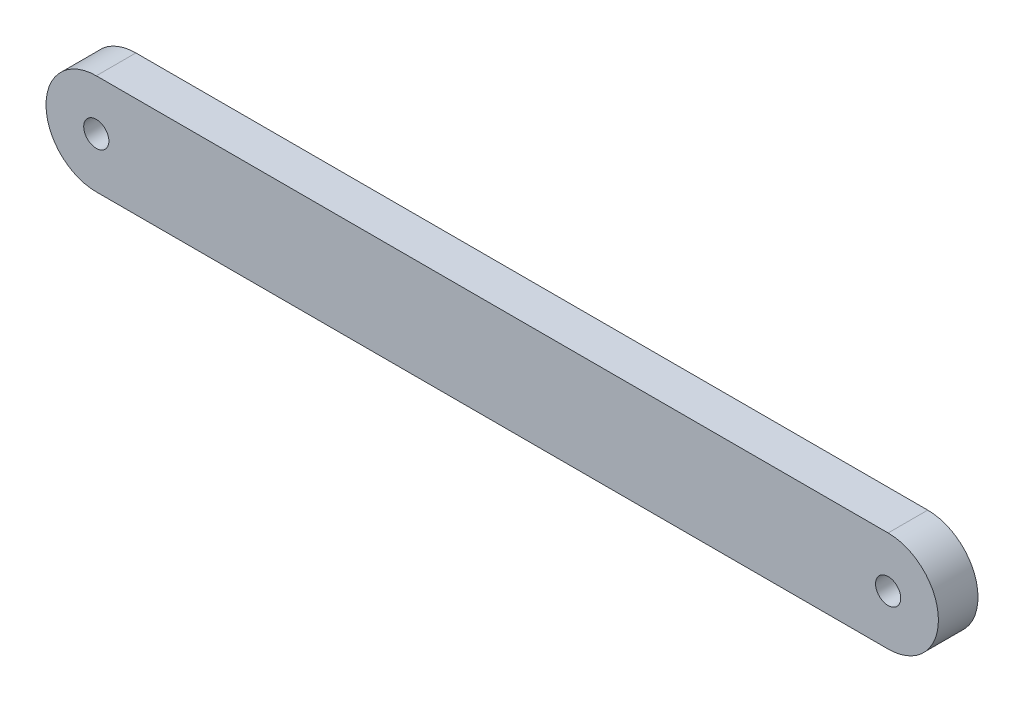
ISO-10303-21;
HEADER;
FILE_DESCRIPTION(('STEP AP214'),'2;1');
FILE_NAME('part.step','',(''),(''),'','','');
FILE_SCHEMA(('AUTOMOTIVE_DESIGN { 1 0 10303 214 1 1 1 1 }'));
ENDSEC;
DATA;
#1=APPLICATION_CONTEXT('core data for automotive mechanical design processes');
#2=APPLICATION_PROTOCOL_DEFINITION('international standard','automotive_design',2000,#1);
#3=PRODUCT_CONTEXT('',#1,'mechanical');
#4=PRODUCT('Part','Part','',(#3));
#5=PRODUCT_RELATED_PRODUCT_CATEGORY('part','',(#4));
#6=PRODUCT_DEFINITION_FORMATION('','',#4);
#7=PRODUCT_DEFINITION_CONTEXT('part definition',#1,'design');
#8=PRODUCT_DEFINITION('design','',#6,#7);
#9=PRODUCT_DEFINITION_SHAPE('','',#8);
#10=(LENGTH_UNIT() NAMED_UNIT(*) SI_UNIT(.MILLI.,.METRE.));
#11=(NAMED_UNIT(*) PLANE_ANGLE_UNIT() SI_UNIT($,.RADIAN.));
#12=(NAMED_UNIT(*) SI_UNIT($,.STERADIAN.) SOLID_ANGLE_UNIT());
#13=UNCERTAINTY_MEASURE_WITH_UNIT(LENGTH_MEASURE(1.E-05),#10,'distance_accuracy_value','');
#14=(GEOMETRIC_REPRESENTATION_CONTEXT(3) GLOBAL_UNCERTAINTY_ASSIGNED_CONTEXT((#13)) GLOBAL_UNIT_ASSIGNED_CONTEXT((#10,
#11,#12)) REPRESENTATION_CONTEXT('',''));
#15=CARTESIAN_POINT('',(0.,0.,0.));
#16=DIRECTION('',(0.,0.,1.));
#17=DIRECTION('',(1.,0.,0.));
#18=AXIS2_PLACEMENT_3D('',#15,#16,#17);
#19=CARTESIAN_POINT('',(0.,0.,10.));
#20=DIRECTION('',(0.,0.,1.));
#21=DIRECTION('',(1.,0.,0.));
#22=AXIS2_PLACEMENT_3D('',#19,#20,#21);
#23=PLANE('',#22);
#24=CARTESIAN_POINT('',(200.,0.,10.));
#25=DIRECTION('',(0.,0.,1.));
#26=DIRECTION('',(1.,0.,0.));
#27=AXIS2_PLACEMENT_3D('',#24,#25,#26);
#28=CIRCLE('',#27,3.17499999999997);
#29=CARTESIAN_POINT('',(203.175,0.,10.));
#30=VERTEX_POINT('',#29);
#31=EDGE_CURVE('E100',#30,#30,#28,.T.);
#32=ORIENTED_EDGE('',*,*,#31,.F.);
#33=EDGE_LOOP('',(#32));
#34=FACE_BOUND('',#33,.T.);
#35=CARTESIAN_POINT('',(0.,0.,10.));
#36=DIRECTION('',(0.,0.,1.));
#37=DIRECTION('',(1.,0.,0.));
#38=AXIS2_PLACEMENT_3D('',#35,#36,#37);
#39=CIRCLE('',#38,12.7);
#40=CARTESIAN_POINT('',(0.,12.7,10.));
#41=VERTEX_POINT('',#40);
#42=CARTESIAN_POINT('',(0.,-12.7,10.));
#43=VERTEX_POINT('',#42);
#44=EDGE_CURVE('E85',#41,#43,#39,.T.);
#45=ORIENTED_EDGE('',*,*,#44,.T.);
#46=DIRECTION('',(1.,0.,0.));
#47=VECTOR('',#46,1.);
#48=CARTESIAN_POINT('',(0.,-12.7,10.));
#49=LINE('',#48,#47);
#50=CARTESIAN_POINT('',(200.,-12.7,10.));
#51=VERTEX_POINT('',#50);
#52=EDGE_CURVE('E80',#43,#51,#49,.T.);
#53=ORIENTED_EDGE('',*,*,#52,.T.);
#54=CARTESIAN_POINT('',(200.,0.,10.));
#55=DIRECTION('',(0.,0.,1.));
#56=DIRECTION('',(1.,0.,0.));
#57=AXIS2_PLACEMENT_3D('',#54,#55,#56);
#58=CIRCLE('',#57,12.7);
#59=CARTESIAN_POINT('',(200.,12.7,10.));
#60=VERTEX_POINT('',#59);
#61=EDGE_CURVE('E83',#51,#60,#58,.T.);
#62=ORIENTED_EDGE('',*,*,#61,.T.);
#63=DIRECTION('',(-1.,0.,0.));
#64=VECTOR('',#63,1.);
#65=CARTESIAN_POINT('',(0.,12.7,10.));
#66=LINE('',#65,#64);
#67=EDGE_CURVE('E50',#60,#41,#66,.T.);
#68=ORIENTED_EDGE('',*,*,#67,.T.);
#69=EDGE_LOOP('',(#45,#53,#62,#68));
#70=FACE_BOUND('',#69,.T.);
#71=CARTESIAN_POINT('',(0.,0.,10.));
#72=DIRECTION('',(0.,0.,1.));
#73=DIRECTION('',(1.,0.,0.));
#74=AXIS2_PLACEMENT_3D('',#71,#72,#73);
#75=CIRCLE('',#74,3.175);
#76=CARTESIAN_POINT('',(3.175,0.,10.));
#77=VERTEX_POINT('',#76);
#78=EDGE_CURVE('E115',#77,#77,#75,.T.);
#79=ORIENTED_EDGE('',*,*,#78,.F.);
#80=EDGE_LOOP('',(#79));
#81=FACE_BOUND('',#80,.T.);
#82=ADVANCED_FACE('F33',(#34,#70,#81),#23,.T.);
#83=CARTESIAN_POINT('',(0.,0.,0.));
#84=DIRECTION('',(0.,0.,1.));
#85=DIRECTION('',(1.,0.,0.));
#86=AXIS2_PLACEMENT_3D('',#83,#84,#85);
#87=PLANE('',#86);
#88=CARTESIAN_POINT('',(200.,0.,0.));
#89=DIRECTION('',(0.,0.,1.));
#90=DIRECTION('',(1.,0.,0.));
#91=AXIS2_PLACEMENT_3D('',#88,#89,#90);
#92=CIRCLE('',#91,3.17499999999997);
#93=CARTESIAN_POINT('',(203.175,0.,0.));
#94=VERTEX_POINT('',#93);
#95=EDGE_CURVE('E112',#94,#94,#92,.T.);
#96=ORIENTED_EDGE('',*,*,#95,.T.);
#97=EDGE_LOOP('',(#96));
#98=FACE_BOUND('',#97,.T.);
#99=CARTESIAN_POINT('',(0.,0.,0.));
#100=DIRECTION('',(0.,0.,1.));
#101=DIRECTION('',(1.,0.,0.));
#102=AXIS2_PLACEMENT_3D('',#99,#100,#101);
#103=CIRCLE('',#102,12.7);
#104=CARTESIAN_POINT('',(0.,12.7,0.));
#105=VERTEX_POINT('',#104);
#106=CARTESIAN_POINT('',(0.,-12.7,0.));
#107=VERTEX_POINT('',#106);
#108=EDGE_CURVE('E97',#105,#107,#103,.T.);
#109=ORIENTED_EDGE('',*,*,#108,.F.);
#110=DIRECTION('',(-1.,0.,0.));
#111=VECTOR('',#110,1.);
#112=CARTESIAN_POINT('',(0.,12.7,0.));
#113=LINE('',#112,#111);
#114=CARTESIAN_POINT('',(200.,12.7,0.));
#115=VERTEX_POINT('',#114);
#116=EDGE_CURVE('E73',#115,#105,#113,.T.);
#117=ORIENTED_EDGE('',*,*,#116,.F.);
#118=CARTESIAN_POINT('',(200.,0.,0.));
#119=DIRECTION('',(0.,0.,1.));
#120=DIRECTION('',(1.,0.,0.));
#121=AXIS2_PLACEMENT_3D('',#118,#119,#120);
#122=CIRCLE('',#121,12.7);
#123=CARTESIAN_POINT('',(200.,-12.7,0.));
#124=VERTEX_POINT('',#123);
#125=EDGE_CURVE('E67',#124,#115,#122,.T.);
#126=ORIENTED_EDGE('',*,*,#125,.F.);
#127=DIRECTION('',(1.,0.,0.));
#128=VECTOR('',#127,1.);
#129=CARTESIAN_POINT('',(0.,-12.7,0.));
#130=LINE('',#129,#128);
#131=EDGE_CURVE('E89',#107,#124,#130,.T.);
#132=ORIENTED_EDGE('',*,*,#131,.F.);
#133=EDGE_LOOP('',(#109,#117,#126,#132));
#134=FACE_BOUND('',#133,.T.);
#135=CARTESIAN_POINT('',(0.,0.,0.));
#136=DIRECTION('',(0.,0.,1.));
#137=DIRECTION('',(1.,0.,0.));
#138=AXIS2_PLACEMENT_3D('',#135,#136,#137);
#139=CIRCLE('',#138,3.175);
#140=CARTESIAN_POINT('',(3.175,0.,0.));
#141=VERTEX_POINT('',#140);
#142=EDGE_CURVE('E118',#141,#141,#139,.T.);
#143=ORIENTED_EDGE('',*,*,#142,.T.);
#144=EDGE_LOOP('',(#143));
#145=FACE_BOUND('',#144,.T.);
#146=ADVANCED_FACE('F108',(#98,#134,#145),#87,.F.);
#147=CARTESIAN_POINT('',(0.,0.,10.));
#148=DIRECTION('',(0.,0.,-1.));
#149=DIRECTION('',(-1.,0.,0.));
#150=AXIS2_PLACEMENT_3D('',#147,#148,#149);
#151=CYLINDRICAL_SURFACE('',#150,12.7);
#152=ORIENTED_EDGE('',*,*,#108,.T.);
#153=DIRECTION('',(0.,0.,-1.));
#154=VECTOR('',#153,1.);
#155=CARTESIAN_POINT('',(0.,-12.7,10.));
#156=LINE('',#155,#154);
#157=EDGE_CURVE('E11',#43,#107,#156,.T.);
#158=ORIENTED_EDGE('',*,*,#157,.F.);
#159=ORIENTED_EDGE('',*,*,#44,.F.);
#160=DIRECTION('',(0.,0.,-1.));
#161=VECTOR('',#160,1.);
#162=CARTESIAN_POINT('',(0.,12.7,10.));
#163=LINE('',#162,#161);
#164=EDGE_CURVE('E93',#41,#105,#163,.T.);
#165=ORIENTED_EDGE('',*,*,#164,.T.);
#166=EDGE_LOOP('',(#152,#158,#159,#165));
#167=FACE_BOUND('',#166,.T.);
#168=ADVANCED_FACE('F35',(#167),#151,.T.);
#169=CARTESIAN_POINT('',(0.,-12.7,10.));
#170=DIRECTION('',(0.,1.,0.));
#171=DIRECTION('',(0.,0.,1.));
#172=AXIS2_PLACEMENT_3D('',#169,#170,#171);
#173=PLANE('',#172);
#174=ORIENTED_EDGE('',*,*,#131,.T.);
#175=DIRECTION('',(0.,0.,-1.));
#176=VECTOR('',#175,1.);
#177=CARTESIAN_POINT('',(200.,-12.7,10.));
#178=LINE('',#177,#176);
#179=EDGE_CURVE('E42',#51,#124,#178,.T.);
#180=ORIENTED_EDGE('',*,*,#179,.F.);
#181=ORIENTED_EDGE('',*,*,#52,.F.);
#182=ORIENTED_EDGE('',*,*,#157,.T.);
#183=EDGE_LOOP('',(#174,#180,#181,#182));
#184=FACE_BOUND('',#183,.T.);
#185=ADVANCED_FACE('F88',(#184),#173,.F.);
#186=CARTESIAN_POINT('',(200.,0.,10.));
#187=DIRECTION('',(0.,0.,-1.));
#188=DIRECTION('',(-1.,0.,0.));
#189=AXIS2_PLACEMENT_3D('',#186,#187,#188);
#190=CYLINDRICAL_SURFACE('',#189,12.7);
#191=ORIENTED_EDGE('',*,*,#125,.T.);
#192=DIRECTION('',(0.,0.,-1.));
#193=VECTOR('',#192,1.);
#194=CARTESIAN_POINT('',(200.,12.7,10.));
#195=LINE('',#194,#193);
#196=EDGE_CURVE('E90',#60,#115,#195,.T.);
#197=ORIENTED_EDGE('',*,*,#196,.F.);
#198=ORIENTED_EDGE('',*,*,#61,.F.);
#199=ORIENTED_EDGE('',*,*,#179,.T.);
#200=EDGE_LOOP('',(#191,#197,#198,#199));
#201=FACE_BOUND('',#200,.T.);
#202=ADVANCED_FACE('F91',(#201),#190,.T.);
#203=CARTESIAN_POINT('',(0.,12.7,10.));
#204=DIRECTION('',(0.,-1.,0.));
#205=DIRECTION('',(1.,0.,0.));
#206=AXIS2_PLACEMENT_3D('',#203,#204,#205);
#207=PLANE('',#206);
#208=ORIENTED_EDGE('',*,*,#116,.T.);
#209=ORIENTED_EDGE('',*,*,#164,.F.);
#210=ORIENTED_EDGE('',*,*,#67,.F.);
#211=ORIENTED_EDGE('',*,*,#196,.T.);
#212=EDGE_LOOP('',(#208,#209,#210,#211));
#213=FACE_BOUND('',#212,.T.);
#214=ADVANCED_FACE('F105',(#213),#207,.F.);
#215=CARTESIAN_POINT('',(200.,0.,10.));
#216=DIRECTION('',(0.,0.,-1.));
#217=DIRECTION('',(-1.,0.,0.));
#218=AXIS2_PLACEMENT_3D('',#215,#216,#217);
#219=CYLINDRICAL_SURFACE('',#218,3.17499999999997);
#220=ORIENTED_EDGE('',*,*,#31,.T.);
#221=EDGE_LOOP('',(#220));
#222=FACE_BOUND('',#221,.T.);
#223=ORIENTED_EDGE('',*,*,#95,.F.);
#224=EDGE_LOOP('',(#223));
#225=FACE_BOUND('',#224,.T.);
#226=ADVANCED_FACE('F136',(#222,#225),#219,.F.);
#227=CARTESIAN_POINT('',(0.,0.,10.));
#228=DIRECTION('',(0.,0.,-1.));
#229=DIRECTION('',(-1.,0.,0.));
#230=AXIS2_PLACEMENT_3D('',#227,#228,#229);
#231=CYLINDRICAL_SURFACE('',#230,3.175);
#232=ORIENTED_EDGE('',*,*,#78,.T.);
#233=EDGE_LOOP('',(#232));
#234=FACE_BOUND('',#233,.T.);
#235=ORIENTED_EDGE('',*,*,#142,.F.);
#236=EDGE_LOOP('',(#235));
#237=FACE_BOUND('',#236,.T.);
#238=ADVANCED_FACE('F124',(#234,#237),#231,.F.);
#239=CLOSED_SHELL('',(#82,#146,#168,#185,#202,#214,#226,#238));
#240=MANIFOLD_SOLID_BREP('B2',#239);
#241=ADVANCED_BREP_SHAPE_REPRESENTATION('',(#18,#240),#14);
#242=SHAPE_DEFINITION_REPRESENTATION(#9,#241);
ENDSEC;
END-ISO-10303-21;
